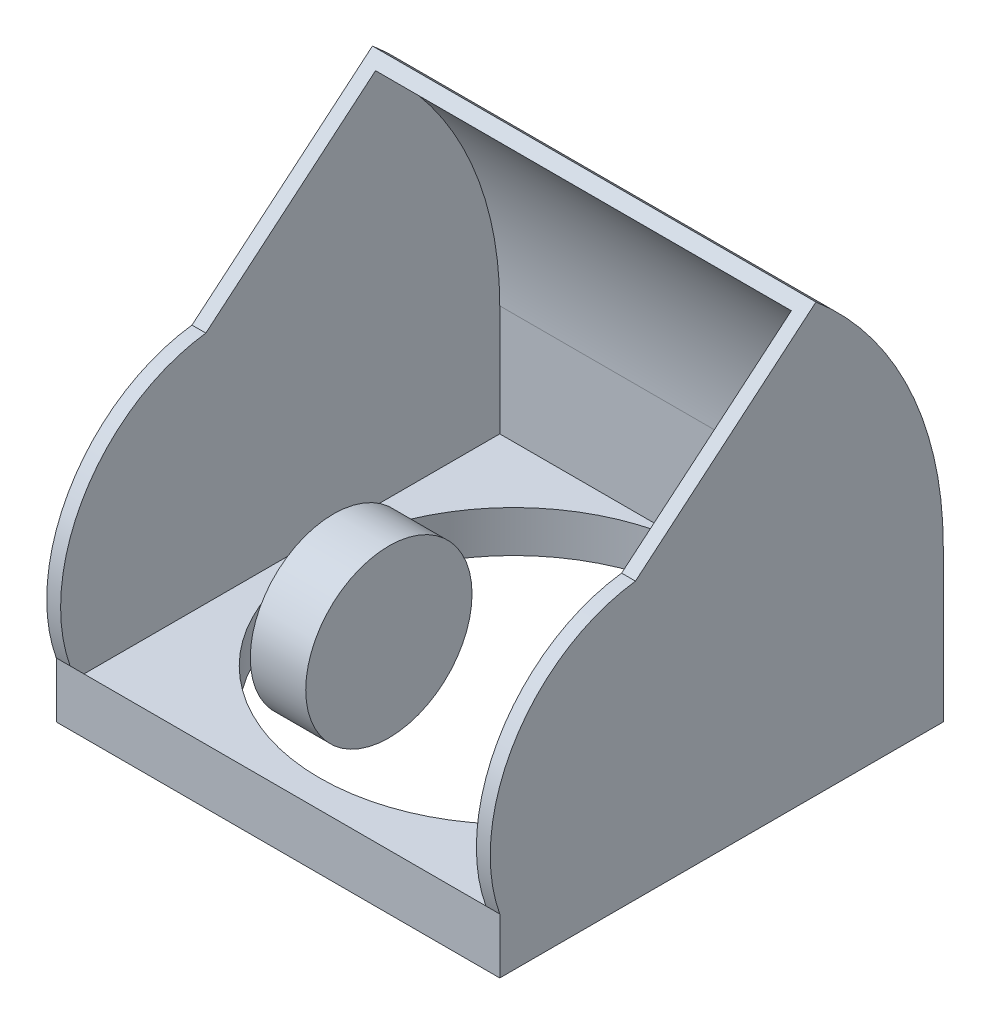
ISO-10303-21;
HEADER;
FILE_DESCRIPTION(('STEP AP214'),'2;1');
FILE_NAME('part.step','',(''),(''),'','','');
FILE_SCHEMA(('AUTOMOTIVE_DESIGN { 1 0 10303 214 1 1 1 1 }'));
ENDSEC;
DATA;
#1=APPLICATION_CONTEXT('core data for automotive mechanical design processes');
#2=APPLICATION_PROTOCOL_DEFINITION('international standard','automotive_design',2000,#1);
#3=PRODUCT_CONTEXT('',#1,'mechanical');
#4=PRODUCT('Part','Part','',(#3));
#5=PRODUCT_RELATED_PRODUCT_CATEGORY('part','',(#4));
#6=PRODUCT_DEFINITION_FORMATION('','',#4);
#7=PRODUCT_DEFINITION_CONTEXT('part definition',#1,'design');
#8=PRODUCT_DEFINITION('design','',#6,#7);
#9=PRODUCT_DEFINITION_SHAPE('','',#8);
#10=(LENGTH_UNIT() NAMED_UNIT(*) SI_UNIT(.MILLI.,.METRE.));
#11=(NAMED_UNIT(*) PLANE_ANGLE_UNIT() SI_UNIT($,.RADIAN.));
#12=(NAMED_UNIT(*) SI_UNIT($,.STERADIAN.) SOLID_ANGLE_UNIT());
#13=UNCERTAINTY_MEASURE_WITH_UNIT(LENGTH_MEASURE(1.E-05),#10,'distance_accuracy_value','');
#14=(GEOMETRIC_REPRESENTATION_CONTEXT(3) GLOBAL_UNCERTAINTY_ASSIGNED_CONTEXT((#13)) GLOBAL_UNIT_ASSIGNED_CONTEXT((#10,
#11,#12)) REPRESENTATION_CONTEXT('',''));
#15=CARTESIAN_POINT('',(0.,0.,0.));
#16=DIRECTION('',(0.,0.,1.));
#17=DIRECTION('',(1.,0.,0.));
#18=AXIS2_PLACEMENT_3D('',#15,#16,#17);
#19=CARTESIAN_POINT('',(12.7,69.85,63.5));
#20=DIRECTION('',(-1.,0.,0.));
#21=DIRECTION('',(0.,0.,1.));
#22=AXIS2_PLACEMENT_3D('',#19,#20,#21);
#23=CYLINDRICAL_SURFACE('',#22,38.1);
#24=CARTESIAN_POINT('',(12.7,69.85,63.5));
#25=DIRECTION('',(1.,0.,0.));
#26=DIRECTION('',(0.,0.,-1.));
#27=AXIS2_PLACEMENT_3D('',#24,#25,#26);
#28=CIRCLE('',#27,38.1);
#29=CARTESIAN_POINT('',(12.7,69.85,25.4));
#30=VERTEX_POINT('',#29);
#31=EDGE_CURVE('E11',#30,#30,#28,.T.);
#32=ORIENTED_EDGE('',*,*,#31,.F.);
#33=EDGE_LOOP('',(#32));
#34=FACE_BOUND('',#33,.T.);
#35=CARTESIAN_POINT('',(-12.7,69.85,63.5));
#36=DIRECTION('',(1.,0.,0.));
#37=DIRECTION('',(0.,0.,-1.));
#38=AXIS2_PLACEMENT_3D('',#35,#36,#37);
#39=CIRCLE('',#38,38.1);
#40=CARTESIAN_POINT('',(-12.7,69.85,25.4));
#41=VERTEX_POINT('',#40);
#42=EDGE_CURVE('E62',#41,#41,#39,.T.);
#43=ORIENTED_EDGE('',*,*,#42,.T.);
#44=EDGE_LOOP('',(#43));
#45=FACE_BOUND('',#44,.T.);
#46=ADVANCED_FACE('F59',(#34,#45),#23,.T.);
#47=CARTESIAN_POINT('',(12.7,69.85,63.5));
#48=DIRECTION('',(1.,0.,0.));
#49=DIRECTION('',(0.,0.,-1.));
#50=AXIS2_PLACEMENT_3D('',#47,#48,#49);
#51=PLANE('',#50);
#52=ORIENTED_EDGE('',*,*,#31,.T.);
#53=EDGE_LOOP('',(#52));
#54=FACE_BOUND('',#53,.T.);
#55=ADVANCED_FACE('F74',(#54),#51,.T.);
#56=CARTESIAN_POINT('',(-12.7,69.85,63.5));
#57=DIRECTION('',(1.,0.,0.));
#58=DIRECTION('',(0.,0.,-1.));
#59=AXIS2_PLACEMENT_3D('',#56,#57,#58);
#60=PLANE('',#59);
#61=ORIENTED_EDGE('',*,*,#42,.F.);
#62=EDGE_LOOP('',(#61));
#63=FACE_BOUND('',#62,.T.);
#64=ADVANCED_FACE('F72',(#63),#60,.F.);
#65=CLOSED_SHELL('',(#46,#55,#64));
#66=MANIFOLD_SOLID_BREP('B2',#65);
#67=CARTESIAN_POINT('',(-370.128638591313,93.575623988376,78.5192715758293));
#68=DIRECTION('',(0.,0.766044443118981,0.642787609686535));
#69=DIRECTION('',(0.,-0.642787609686535,0.766044443118982));
#70=AXIS2_PLACEMENT_3D('',#67,#68,#69);
#71=PLANE('',#70);
#72=DIRECTION('',(1.,0.,0.));
#73=VECTOR('',#72,1.);
#74=CARTESIAN_POINT('',(-370.128638591313,126.385156276769,39.4183935998013));
#75=LINE('',#74,#73);
#76=CARTESIAN_POINT('',(-101.6,126.385156276769,39.4183935998012));
#77=VERTEX_POINT('',#76);
#78=CARTESIAN_POINT('',(-95.25,126.385156276769,39.4183935998012));
#79=VERTEX_POINT('',#78);
#80=EDGE_CURVE('E295',#77,#79,#75,.T.);
#81=ORIENTED_EDGE('',*,*,#80,.T.);
#82=DIRECTION('',(0.,0.642787609686535,-0.766044443118982));
#83=VECTOR('',#82,1.);
#84=CARTESIAN_POINT('',(-95.25,93.5756239883759,78.5192715758293));
#85=LINE('',#84,#83);
#86=CARTESIAN_POINT('',(-95.25,191.630702173967,-38.3382201239567));
#87=VERTEX_POINT('',#86);
#88=EDGE_CURVE('E252',#79,#87,#85,.T.);
#89=ORIENTED_EDGE('',*,*,#88,.T.);
#90=DIRECTION('',(1.,0.,0.));
#91=VECTOR('',#90,1.);
#92=CARTESIAN_POINT('',(-95.25,191.630702173967,-38.3382201239567));
#93=LINE('',#92,#91);
#94=CARTESIAN_POINT('',(95.25,191.630702173967,-38.3382201239567));
#95=VERTEX_POINT('',#94);
#96=EDGE_CURVE('E229',#87,#95,#93,.T.);
#97=ORIENTED_EDGE('',*,*,#96,.T.);
#98=DIRECTION('',(0.,-0.642787609686535,0.766044443118982));
#99=VECTOR('',#98,1.);
#100=CARTESIAN_POINT('',(95.25,93.5756239883759,78.5192715758292));
#101=LINE('',#100,#99);
#102=CARTESIAN_POINT('',(95.25,126.385156276769,39.4183935998012));
#103=VERTEX_POINT('',#102);
#104=EDGE_CURVE('E233',#95,#103,#101,.T.);
#105=ORIENTED_EDGE('',*,*,#104,.T.);
#106=CARTESIAN_POINT('',(101.6,126.385156276769,39.4183935998012));
#107=VERTEX_POINT('',#106);
#108=EDGE_CURVE('E288',#103,#107,#75,.T.);
#109=ORIENTED_EDGE('',*,*,#108,.T.);
#110=DIRECTION('',(0.,-0.642787609686535,0.766044443118981));
#111=VECTOR('',#110,1.);
#112=CARTESIAN_POINT('',(101.6,93.575623988376,78.5192715758292));
#113=LINE('',#112,#111);
#114=CARTESIAN_POINT('',(101.6,195.77407874243,-43.2761040348929));
#115=VERTEX_POINT('',#114);
#116=EDGE_CURVE('E267',#115,#107,#113,.T.);
#117=ORIENTED_EDGE('',*,*,#116,.F.);
#118=DIRECTION('',(1.,0.,0.));
#119=VECTOR('',#118,1.);
#120=CARTESIAN_POINT('',(-370.128638591313,195.77407874243,-43.2761040348928));
#121=LINE('',#120,#119);
#122=CARTESIAN_POINT('',(-101.6,195.77407874243,-43.2761040348928));
#123=VERTEX_POINT('',#122);
#124=EDGE_CURVE('E273',#123,#115,#121,.T.);
#125=ORIENTED_EDGE('',*,*,#124,.F.);
#126=DIRECTION('',(0.,0.642787609686535,-0.766044443118982));
#127=VECTOR('',#126,1.);
#128=CARTESIAN_POINT('',(-101.6,93.5756239883759,78.5192715758293));
#129=LINE('',#128,#127);
#130=EDGE_CURVE('E272',#77,#123,#129,.T.);
#131=ORIENTED_EDGE('',*,*,#130,.F.);
#132=EDGE_LOOP('',(#81,#89,#97,#105,#109,#117,#125,#131));
#133=FACE_BOUND('',#132,.T.);
#134=ADVANCED_FACE('F112',(#133),#71,.T.);
#135=CARTESIAN_POINT('',(-370.128638591313,50.8,29.7579510314469));
#136=DIRECTION('',(1.,0.,0.));
#137=DIRECTION('',(0.,0.,-1.));
#138=AXIS2_PLACEMENT_3D('',#135,#136,#137);
#139=CYLINDRICAL_SURFACE('',#138,76.2);
#140=DIRECTION('',(1.,0.,0.));
#141=VECTOR('',#140,1.);
#142=CARTESIAN_POINT('',(-101.6,25.4,101.6));
#143=LINE('',#142,#141);
#144=CARTESIAN_POINT('',(-101.6,25.4,101.6));
#145=VERTEX_POINT('',#144);
#146=CARTESIAN_POINT('',(-95.25,25.4,101.6));
#147=VERTEX_POINT('',#146);
#148=EDGE_CURVE('E302',#145,#147,#143,.T.);
#149=ORIENTED_EDGE('',*,*,#148,.T.);
#150=CARTESIAN_POINT('',(-95.25,50.8,29.7579510314468));
#151=DIRECTION('',(1.,0.,0.));
#152=DIRECTION('',(0.,0.,-1.));
#153=AXIS2_PLACEMENT_3D('',#150,#151,#152);
#154=CIRCLE('',#153,76.2);
#155=EDGE_CURVE('E57',#147,#79,#154,.F.);
#156=ORIENTED_EDGE('',*,*,#155,.T.);
#157=ORIENTED_EDGE('',*,*,#80,.F.);
#158=CARTESIAN_POINT('',(-101.6,50.8,29.7579510314468));
#159=DIRECTION('',(1.,0.,0.));
#160=DIRECTION('',(0.,0.,-1.));
#161=AXIS2_PLACEMENT_3D('',#158,#159,#160);
#162=CIRCLE('',#161,76.2);
#163=EDGE_CURVE('E276',#145,#77,#162,.F.);
#164=ORIENTED_EDGE('',*,*,#163,.F.);
#165=EDGE_LOOP('',(#149,#156,#157,#164));
#166=FACE_BOUND('',#165,.T.);
#167=ADVANCED_FACE('F353',(#166),#139,.T.);
#168=ORIENTED_EDGE('',*,*,#108,.F.);
#169=CARTESIAN_POINT('',(95.25,50.8,29.7579510314468));
#170=DIRECTION('',(-1.,0.,0.));
#171=DIRECTION('',(0.,0.,1.));
#172=AXIS2_PLACEMENT_3D('',#169,#170,#171);
#173=CIRCLE('',#172,76.2);
#174=CARTESIAN_POINT('',(95.25,25.4,101.6));
#175=VERTEX_POINT('',#174);
#176=EDGE_CURVE('E235',#103,#175,#173,.F.);
#177=ORIENTED_EDGE('',*,*,#176,.T.);
#178=CARTESIAN_POINT('',(101.6,25.4,101.6));
#179=VERTEX_POINT('',#178);
#180=EDGE_CURVE('E308',#175,#179,#143,.T.);
#181=ORIENTED_EDGE('',*,*,#180,.T.);
#182=CARTESIAN_POINT('',(101.6,50.8,29.7579510314468));
#183=DIRECTION('',(1.,0.,0.));
#184=DIRECTION('',(0.,0.,-1.));
#185=AXIS2_PLACEMENT_3D('',#182,#183,#184);
#186=CIRCLE('',#185,76.2);
#187=EDGE_CURVE('E280',#107,#179,#186,.T.);
#188=ORIENTED_EDGE('',*,*,#187,.F.);
#189=EDGE_LOOP('',(#168,#177,#181,#188));
#190=FACE_BOUND('',#189,.T.);
#191=ADVANCED_FACE('F364',(#190),#139,.T.);
#192=CARTESIAN_POINT('',(101.6,25.4,-101.6));
#193=DIRECTION('',(-1.,0.,0.));
#194=DIRECTION('',(0.,0.,1.));
#195=AXIS2_PLACEMENT_3D('',#192,#193,#194);
#196=PLANE('',#195);
#197=DIRECTION('',(0.,0.,-1.));
#198=VECTOR('',#197,1.);
#199=CARTESIAN_POINT('',(101.6,0.,-101.6));
#200=LINE('',#199,#198);
#201=CARTESIAN_POINT('',(101.6,0.,101.6));
#202=VERTEX_POINT('',#201);
#203=CARTESIAN_POINT('',(101.6,0.,-101.6));
#204=VERTEX_POINT('',#203);
#205=EDGE_CURVE('E301',#202,#204,#200,.T.);
#206=ORIENTED_EDGE('',*,*,#205,.T.);
#207=DIRECTION('',(0.,-1.,0.));
#208=VECTOR('',#207,1.);
#209=CARTESIAN_POINT('',(101.6,25.4,-101.6));
#210=LINE('',#209,#208);
#211=CARTESIAN_POINT('',(101.6,69.85,-101.6));
#212=VERTEX_POINT('',#211);
#213=EDGE_CURVE('E116',#212,#204,#210,.T.);
#214=ORIENTED_EDGE('',*,*,#213,.F.);
#215=CARTESIAN_POINT('',(101.6,69.85,63.5));
#216=DIRECTION('',(1.,0.,0.));
#217=DIRECTION('',(0.,0.,-1.));
#218=AXIS2_PLACEMENT_3D('',#215,#216,#217);
#219=CIRCLE('',#218,165.1);
#220=EDGE_CURVE('E284',#212,#115,#219,.T.);
#221=ORIENTED_EDGE('',*,*,#220,.T.);
#222=ORIENTED_EDGE('',*,*,#116,.T.);
#223=ORIENTED_EDGE('',*,*,#187,.T.);
#224=DIRECTION('',(0.,-1.,0.));
#225=VECTOR('',#224,1.);
#226=CARTESIAN_POINT('',(101.6,25.4,101.6));
#227=LINE('',#226,#225);
#228=EDGE_CURVE('E306',#179,#202,#227,.T.);
#229=ORIENTED_EDGE('',*,*,#228,.T.);
#230=EDGE_LOOP('',(#206,#214,#221,#222,#223,#229));
#231=FACE_BOUND('',#230,.T.);
#232=ADVANCED_FACE('F114',(#231),#196,.F.);
#233=CARTESIAN_POINT('',(-101.6,25.4,-101.6));
#234=DIRECTION('',(0.,0.,1.));
#235=DIRECTION('',(1.,0.,0.));
#236=AXIS2_PLACEMENT_3D('',#233,#234,#235);
#237=PLANE('',#236);
#238=DIRECTION('',(-1.,0.,0.));
#239=VECTOR('',#238,1.);
#240=CARTESIAN_POINT('',(-101.6,0.,-101.6));
#241=LINE('',#240,#239);
#242=CARTESIAN_POINT('',(-101.6,0.,-101.6));
#243=VERTEX_POINT('',#242);
#244=EDGE_CURVE('E312',#204,#243,#241,.T.);
#245=ORIENTED_EDGE('',*,*,#244,.T.);
#246=DIRECTION('',(0.,-1.,0.));
#247=VECTOR('',#246,1.);
#248=CARTESIAN_POINT('',(-101.6,25.4,-101.6));
#249=LINE('',#248,#247);
#250=CARTESIAN_POINT('',(-101.6,69.85,-101.6));
#251=VERTEX_POINT('',#250);
#252=EDGE_CURVE('E327',#251,#243,#249,.T.);
#253=ORIENTED_EDGE('',*,*,#252,.F.);
#254=DIRECTION('',(1.,0.,0.));
#255=VECTOR('',#254,1.);
#256=CARTESIAN_POINT('',(-370.128638591313,69.85,-101.6));
#257=LINE('',#256,#255);
#258=EDGE_CURVE('E291',#251,#212,#257,.T.);
#259=ORIENTED_EDGE('',*,*,#258,.T.);
#260=ORIENTED_EDGE('',*,*,#213,.T.);
#261=EDGE_LOOP('',(#245,#253,#259,#260));
#262=FACE_BOUND('',#261,.T.);
#263=ADVANCED_FACE('F335',(#262),#237,.F.);
#264=CARTESIAN_POINT('',(-101.6,25.4,-101.6));
#265=DIRECTION('',(1.,0.,0.));
#266=DIRECTION('',(0.,0.,-1.));
#267=AXIS2_PLACEMENT_3D('',#264,#265,#266);
#268=PLANE('',#267);
#269=DIRECTION('',(0.,0.,1.));
#270=VECTOR('',#269,1.);
#271=CARTESIAN_POINT('',(-101.6,0.,-101.6));
#272=LINE('',#271,#270);
#273=CARTESIAN_POINT('',(-101.6,0.,101.6));
#274=VERTEX_POINT('',#273);
#275=EDGE_CURVE('E315',#243,#274,#272,.T.);
#276=ORIENTED_EDGE('',*,*,#275,.T.);
#277=DIRECTION('',(0.,-1.,0.));
#278=VECTOR('',#277,1.);
#279=CARTESIAN_POINT('',(-101.6,25.4,101.6));
#280=LINE('',#279,#278);
#281=EDGE_CURVE('E324',#145,#274,#280,.T.);
#282=ORIENTED_EDGE('',*,*,#281,.F.);
#283=ORIENTED_EDGE('',*,*,#163,.T.);
#284=ORIENTED_EDGE('',*,*,#130,.T.);
#285=CARTESIAN_POINT('',(-101.6,69.85,63.5));
#286=DIRECTION('',(1.,0.,0.));
#287=DIRECTION('',(0.,0.,-1.));
#288=AXIS2_PLACEMENT_3D('',#285,#286,#287);
#289=CIRCLE('',#288,165.1);
#290=EDGE_CURVE('E268',#123,#251,#289,.F.);
#291=ORIENTED_EDGE('',*,*,#290,.T.);
#292=ORIENTED_EDGE('',*,*,#252,.T.);
#293=EDGE_LOOP('',(#276,#282,#283,#284,#291,#292));
#294=FACE_BOUND('',#293,.T.);
#295=ADVANCED_FACE('F344',(#294),#268,.F.);
#296=CARTESIAN_POINT('',(-101.6,25.4,101.6));
#297=DIRECTION('',(0.,0.,-1.));
#298=DIRECTION('',(-1.,0.,0.));
#299=AXIS2_PLACEMENT_3D('',#296,#297,#298);
#300=PLANE('',#299);
#301=DIRECTION('',(1.,0.,0.));
#302=VECTOR('',#301,1.);
#303=CARTESIAN_POINT('',(-101.6,0.,101.6));
#304=LINE('',#303,#302);
#305=EDGE_CURVE('E318',#274,#202,#304,.T.);
#306=ORIENTED_EDGE('',*,*,#305,.T.);
#307=ORIENTED_EDGE('',*,*,#228,.F.);
#308=ORIENTED_EDGE('',*,*,#180,.F.);
#309=EDGE_CURVE('E307',#147,#175,#143,.T.);
#310=ORIENTED_EDGE('',*,*,#309,.F.);
#311=ORIENTED_EDGE('',*,*,#148,.F.);
#312=ORIENTED_EDGE('',*,*,#281,.T.);
#313=EDGE_LOOP('',(#306,#307,#308,#310,#311,#312));
#314=FACE_BOUND('',#313,.T.);
#315=ADVANCED_FACE('F347',(#314),#300,.F.);
#316=CARTESIAN_POINT('',(0.,0.,0.));
#317=DIRECTION('',(0.,1.,0.));
#318=DIRECTION('',(0.,0.,1.));
#319=AXIS2_PLACEMENT_3D('',#316,#317,#318);
#320=PLANE('',#319);
#321=CARTESIAN_POINT('',(0.,0.,-6.35000000000004));
#322=DIRECTION('',(0.,1.,0.));
#323=DIRECTION('',(0.,0.,1.));
#324=AXIS2_PLACEMENT_3D('',#321,#322,#323);
#325=CIRCLE('',#324,88.9);
#326=CARTESIAN_POINT('',(0.,0.,82.55));
#327=VERTEX_POINT('',#326);
#328=EDGE_CURVE('E255',#327,#327,#325,.T.);
#329=ORIENTED_EDGE('',*,*,#328,.T.);
#330=EDGE_LOOP('',(#329));
#331=FACE_BOUND('',#330,.T.);
#332=ORIENTED_EDGE('',*,*,#205,.F.);
#333=ORIENTED_EDGE('',*,*,#305,.F.);
#334=ORIENTED_EDGE('',*,*,#275,.F.);
#335=ORIENTED_EDGE('',*,*,#244,.F.);
#336=EDGE_LOOP('',(#332,#333,#334,#335));
#337=FACE_BOUND('',#336,.T.);
#338=ADVANCED_FACE('F343',(#331,#337),#320,.F.);
#339=CARTESIAN_POINT('',(-370.128638591313,69.85,63.5000000000001));
#340=DIRECTION('',(1.,0.,0.));
#341=DIRECTION('',(0.,0.,-1.));
#342=AXIS2_PLACEMENT_3D('',#339,#340,#341);
#343=CYLINDRICAL_SURFACE('',#342,165.1);
#344=ORIENTED_EDGE('',*,*,#290,.F.);
#345=ORIENTED_EDGE('',*,*,#124,.T.);
#346=ORIENTED_EDGE('',*,*,#220,.F.);
#347=ORIENTED_EDGE('',*,*,#258,.F.);
#348=EDGE_LOOP('',(#344,#345,#346,#347));
#349=FACE_BOUND('',#348,.T.);
#350=ADVANCED_FACE('F360',(#349),#343,.T.);
#351=CARTESIAN_POINT('',(95.25,25.4,-101.6));
#352=DIRECTION('',(-1.,0.,0.));
#353=DIRECTION('',(0.,0.,1.));
#354=AXIS2_PLACEMENT_3D('',#351,#352,#353);
#355=PLANE('',#354);
#356=DIRECTION('',(0.,0.,-1.));
#357=VECTOR('',#356,1.);
#358=CARTESIAN_POINT('',(95.25,19.05,-101.6));
#359=LINE('',#358,#357);
#360=CARTESIAN_POINT('',(95.25,19.05,99.0282729593835));
#361=VERTEX_POINT('',#360);
#362=CARTESIAN_POINT('',(95.25,19.05,-95.25));
#363=VERTEX_POINT('',#362);
#364=EDGE_CURVE('E262',#361,#363,#359,.T.);
#365=ORIENTED_EDGE('',*,*,#364,.F.);
#366=EDGE_CURVE('E135',#175,#361,#173,.F.);
#367=ORIENTED_EDGE('',*,*,#366,.F.);
#368=ORIENTED_EDGE('',*,*,#176,.F.);
#369=ORIENTED_EDGE('',*,*,#104,.F.);
#370=CARTESIAN_POINT('',(95.25,69.85,63.5));
#371=DIRECTION('',(-1.,0.,0.));
#372=DIRECTION('',(0.,0.,1.));
#373=AXIS2_PLACEMENT_3D('',#370,#371,#372);
#374=CIRCLE('',#373,158.75);
#375=CARTESIAN_POINT('',(95.25,69.85,-95.25));
#376=VERTEX_POINT('',#375);
#377=EDGE_CURVE('E225',#376,#95,#374,.F.);
#378=ORIENTED_EDGE('',*,*,#377,.F.);
#379=DIRECTION('',(0.,-1.,0.));
#380=VECTOR('',#379,1.);
#381=CARTESIAN_POINT('',(95.25,25.4,-95.25));
#382=LINE('',#381,#380);
#383=EDGE_CURVE('E206',#376,#363,#382,.T.);
#384=ORIENTED_EDGE('',*,*,#383,.T.);
#385=EDGE_LOOP('',(#365,#367,#368,#369,#378,#384));
#386=FACE_BOUND('',#385,.T.);
#387=ADVANCED_FACE('F231',(#386),#355,.T.);
#388=CARTESIAN_POINT('',(-101.6,25.4,-95.25));
#389=DIRECTION('',(0.,0.,1.));
#390=DIRECTION('',(1.,0.,0.));
#391=AXIS2_PLACEMENT_3D('',#388,#389,#390);
#392=PLANE('',#391);
#393=DIRECTION('',(-1.,0.,0.));
#394=VECTOR('',#393,1.);
#395=CARTESIAN_POINT('',(-101.6,19.05,-95.25));
#396=LINE('',#395,#394);
#397=CARTESIAN_POINT('',(0.,19.05,-95.25));
#398=VERTEX_POINT('',#397);
#399=EDGE_CURVE('E213',#363,#398,#396,.T.);
#400=ORIENTED_EDGE('',*,*,#399,.F.);
#401=ORIENTED_EDGE('',*,*,#383,.F.);
#402=DIRECTION('',(1.,0.,0.));
#403=VECTOR('',#402,1.);
#404=CARTESIAN_POINT('',(-101.6,69.85,-95.25));
#405=LINE('',#404,#403);
#406=CARTESIAN_POINT('',(-95.25,69.85,-95.25));
#407=VERTEX_POINT('',#406);
#408=EDGE_CURVE('E210',#407,#376,#405,.T.);
#409=ORIENTED_EDGE('',*,*,#408,.F.);
#410=DIRECTION('',(0.,-1.,0.));
#411=VECTOR('',#410,1.);
#412=CARTESIAN_POINT('',(-95.25,25.4,-95.25));
#413=LINE('',#412,#411);
#414=CARTESIAN_POINT('',(-95.25,19.05,-95.25));
#415=VERTEX_POINT('',#414);
#416=EDGE_CURVE('E218',#407,#415,#413,.T.);
#417=ORIENTED_EDGE('',*,*,#416,.T.);
#418=EDGE_CURVE('E245',#398,#415,#396,.T.);
#419=ORIENTED_EDGE('',*,*,#418,.F.);
#420=EDGE_LOOP('',(#400,#401,#409,#417,#419));
#421=FACE_BOUND('',#420,.T.);
#422=ADVANCED_FACE('F208',(#421),#392,.T.);
#423=CARTESIAN_POINT('',(-95.25,25.4,-101.6));
#424=DIRECTION('',(1.,0.,0.));
#425=DIRECTION('',(0.,0.,-1.));
#426=AXIS2_PLACEMENT_3D('',#423,#424,#425);
#427=PLANE('',#426);
#428=DIRECTION('',(0.,0.,1.));
#429=VECTOR('',#428,1.);
#430=CARTESIAN_POINT('',(-95.25,19.05,-101.6));
#431=LINE('',#430,#429);
#432=CARTESIAN_POINT('',(-95.25,19.05,99.0282729593836));
#433=VERTEX_POINT('',#432);
#434=EDGE_CURVE('E244',#415,#433,#431,.T.);
#435=ORIENTED_EDGE('',*,*,#434,.F.);
#436=ORIENTED_EDGE('',*,*,#416,.F.);
#437=CARTESIAN_POINT('',(-95.25,69.85,63.5));
#438=DIRECTION('',(1.,0.,0.));
#439=DIRECTION('',(0.,0.,-1.));
#440=AXIS2_PLACEMENT_3D('',#437,#438,#439);
#441=CIRCLE('',#440,158.75);
#442=EDGE_CURVE('E227',#87,#407,#441,.F.);
#443=ORIENTED_EDGE('',*,*,#442,.F.);
#444=ORIENTED_EDGE('',*,*,#88,.F.);
#445=ORIENTED_EDGE('',*,*,#155,.F.);
#446=EDGE_CURVE('E123',#433,#147,#154,.F.);
#447=ORIENTED_EDGE('',*,*,#446,.F.);
#448=EDGE_LOOP('',(#435,#436,#443,#444,#445,#447));
#449=FACE_BOUND('',#448,.T.);
#450=ADVANCED_FACE('F373',(#449),#427,.T.);
#451=CARTESIAN_POINT('',(0.,19.05,0.));
#452=DIRECTION('',(0.,1.,0.));
#453=DIRECTION('',(0.,0.,1.));
#454=AXIS2_PLACEMENT_3D('',#451,#452,#453);
#455=PLANE('',#454);
#456=ORIENTED_EDGE('',*,*,#399,.T.);
#457=CARTESIAN_POINT('',(0.,19.05,-6.35000000000004));
#458=DIRECTION('',(0.,1.,0.));
#459=DIRECTION('',(0.,0.,1.));
#460=AXIS2_PLACEMENT_3D('',#457,#458,#459);
#461=CIRCLE('',#460,88.9);
#462=EDGE_CURVE('E128',#398,#398,#461,.T.);
#463=ORIENTED_EDGE('',*,*,#462,.F.);
#464=ORIENTED_EDGE('',*,*,#418,.T.);
#465=ORIENTED_EDGE('',*,*,#434,.T.);
#466=DIRECTION('',(1.,0.,0.));
#467=VECTOR('',#466,1.);
#468=CARTESIAN_POINT('',(-370.128638591313,19.05,99.0282729593836));
#469=LINE('',#468,#467);
#470=EDGE_CURVE('E217',#361,#433,#469,.F.);
#471=ORIENTED_EDGE('',*,*,#470,.F.);
#472=ORIENTED_EDGE('',*,*,#364,.T.);
#473=EDGE_LOOP('',(#456,#463,#464,#465,#471,#472));
#474=FACE_BOUND('',#473,.T.);
#475=ADVANCED_FACE('F441',(#474),#455,.T.);
#476=CARTESIAN_POINT('',(-370.128638591313,69.85,63.5000000000001));
#477=DIRECTION('',(1.,0.,0.));
#478=DIRECTION('',(0.,0.,-1.));
#479=AXIS2_PLACEMENT_3D('',#476,#477,#478);
#480=CYLINDRICAL_SURFACE('',#479,158.75);
#481=ORIENTED_EDGE('',*,*,#442,.T.);
#482=ORIENTED_EDGE('',*,*,#408,.T.);
#483=ORIENTED_EDGE('',*,*,#377,.T.);
#484=ORIENTED_EDGE('',*,*,#96,.F.);
#485=EDGE_LOOP('',(#481,#482,#483,#484));
#486=FACE_BOUND('',#485,.T.);
#487=ADVANCED_FACE('F223',(#486),#480,.F.);
#488=CARTESIAN_POINT('',(-370.128638591313,50.8,29.7579510314469));
#489=DIRECTION('',(1.,0.,0.));
#490=DIRECTION('',(0.,0.,-1.));
#491=AXIS2_PLACEMENT_3D('',#488,#489,#490);
#492=CYLINDRICAL_SURFACE('',#491,76.2);
#493=ORIENTED_EDGE('',*,*,#309,.T.);
#494=ORIENTED_EDGE('',*,*,#366,.T.);
#495=ORIENTED_EDGE('',*,*,#470,.T.);
#496=ORIENTED_EDGE('',*,*,#446,.T.);
#497=EDGE_LOOP('',(#493,#494,#495,#496));
#498=FACE_BOUND('',#497,.T.);
#499=ADVANCED_FACE('F368',(#498),#492,.F.);
#500=CARTESIAN_POINT('',(0.,0.,-6.35000000000004));
#501=DIRECTION('',(0.,1.,0.));
#502=DIRECTION('',(0.,0.,1.));
#503=AXIS2_PLACEMENT_3D('',#500,#501,#502);
#504=CYLINDRICAL_SURFACE('',#503,88.9);
#505=ORIENTED_EDGE('',*,*,#328,.F.);
#506=EDGE_LOOP('',(#505));
#507=FACE_BOUND('',#506,.T.);
#508=ORIENTED_EDGE('',*,*,#462,.T.);
#509=EDGE_LOOP('',(#508));
#510=FACE_BOUND('',#509,.T.);
#511=ADVANCED_FACE('F386',(#507,#510),#504,.F.);
#512=CLOSED_SHELL('',(#134,#167,#191,#232,#263,#295,#315,#338,#350,#387,#422,#450,#475,#487,
#499,#511));
#513=MANIFOLD_SOLID_BREP('B6',#512);
#514=ADVANCED_BREP_SHAPE_REPRESENTATION('',(#18,#66,#513),#14);
#515=SHAPE_DEFINITION_REPRESENTATION(#9,#514);
ENDSEC;
END-ISO-10303-21;
